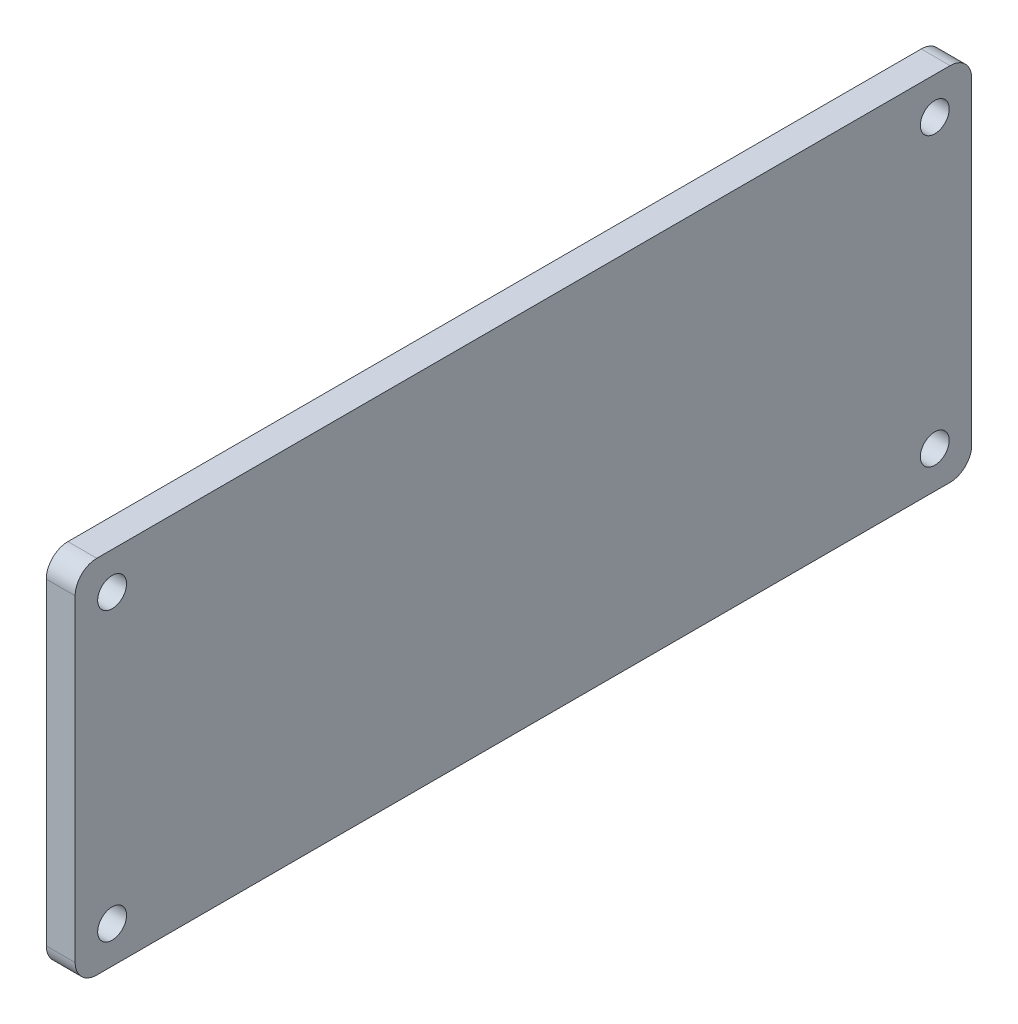
ISO-10303-21;
HEADER;
FILE_DESCRIPTION(('STEP AP214'),'2;1');
FILE_NAME('part.step','',(''),(''),'','','');
FILE_SCHEMA(('AUTOMOTIVE_DESIGN { 1 0 10303 214 1 1 1 1 }'));
ENDSEC;
DATA;
#1=APPLICATION_CONTEXT('core data for automotive mechanical design processes');
#2=APPLICATION_PROTOCOL_DEFINITION('international standard','automotive_design',2000,#1);
#3=PRODUCT_CONTEXT('',#1,'mechanical');
#4=PRODUCT('Part','Part','',(#3));
#5=PRODUCT_RELATED_PRODUCT_CATEGORY('part','',(#4));
#6=PRODUCT_DEFINITION_FORMATION('','',#4);
#7=PRODUCT_DEFINITION_CONTEXT('part definition',#1,'design');
#8=PRODUCT_DEFINITION('design','',#6,#7);
#9=PRODUCT_DEFINITION_SHAPE('','',#8);
#10=(LENGTH_UNIT() NAMED_UNIT(*) SI_UNIT(.MILLI.,.METRE.));
#11=(NAMED_UNIT(*) PLANE_ANGLE_UNIT() SI_UNIT($,.RADIAN.));
#12=(NAMED_UNIT(*) SI_UNIT($,.STERADIAN.) SOLID_ANGLE_UNIT());
#13=UNCERTAINTY_MEASURE_WITH_UNIT(LENGTH_MEASURE(1.E-05),#10,'distance_accuracy_value','');
#14=(GEOMETRIC_REPRESENTATION_CONTEXT(3) GLOBAL_UNCERTAINTY_ASSIGNED_CONTEXT((#13)) GLOBAL_UNIT_ASSIGNED_CONTEXT((#10,
#11,#12)) REPRESENTATION_CONTEXT('',''));
#15=CARTESIAN_POINT('',(0.,0.,0.));
#16=DIRECTION('',(0.,0.,1.));
#17=DIRECTION('',(1.,0.,0.));
#18=AXIS2_PLACEMENT_3D('',#15,#16,#17);
#19=CARTESIAN_POINT('',(2.,11.,29.55));
#20=DIRECTION('',(-1.,0.,0.));
#21=DIRECTION('',(0.,0.,1.));
#22=AXIS2_PLACEMENT_3D('',#19,#20,#21);
#23=PLANE('',#22);
#24=CARTESIAN_POINT('',(2.,-9.93933982822018,-28.4893398282202));
#25=DIRECTION('',(-1.,0.,0.));
#26=DIRECTION('',(0.,0.,1.));
#27=AXIS2_PLACEMENT_3D('',#24,#25,#26);
#28=CIRCLE('',#27,1.);
#29=CARTESIAN_POINT('',(2.,-9.93933982822018,-27.4893398282202));
#30=VERTEX_POINT('',#29);
#31=EDGE_CURVE('E319',#30,#30,#28,.T.);
#32=ORIENTED_EDGE('',*,*,#31,.T.);
#33=EDGE_LOOP('',(#32));
#34=FACE_BOUND('',#33,.T.);
#35=CARTESIAN_POINT('',(2.,9.93933982822018,28.4893398282202));
#36=DIRECTION('',(-1.,0.,0.));
#37=DIRECTION('',(0.,0.,1.));
#38=AXIS2_PLACEMENT_3D('',#35,#36,#37);
#39=CIRCLE('',#38,1.);
#40=CARTESIAN_POINT('',(2.,9.93933982822018,29.4893398282202));
#41=VERTEX_POINT('',#40);
#42=EDGE_CURVE('E241',#41,#41,#39,.T.);
#43=ORIENTED_EDGE('',*,*,#42,.T.);
#44=EDGE_LOOP('',(#43));
#45=FACE_BOUND('',#44,.T.);
#46=CARTESIAN_POINT('',(2.,11.,29.55));
#47=DIRECTION('',(-1.,0.,0.));
#48=DIRECTION('',(0.,0.,1.));
#49=AXIS2_PLACEMENT_3D('',#46,#47,#48);
#50=CIRCLE('',#49,1.5);
#51=CARTESIAN_POINT('',(2.,11.,31.05));
#52=VERTEX_POINT('',#51);
#53=CARTESIAN_POINT('',(2.,12.5,29.55));
#54=VERTEX_POINT('',#53);
#55=EDGE_CURVE('E257',#52,#54,#50,.T.);
#56=ORIENTED_EDGE('',*,*,#55,.F.);
#57=DIRECTION('',(0.,1.,0.));
#58=VECTOR('',#57,1.);
#59=CARTESIAN_POINT('',(2.,-11.,31.05));
#60=LINE('',#59,#58);
#61=CARTESIAN_POINT('',(2.,-11.,31.05));
#62=VERTEX_POINT('',#61);
#63=EDGE_CURVE('E232',#62,#52,#60,.T.);
#64=ORIENTED_EDGE('',*,*,#63,.F.);
#65=CARTESIAN_POINT('',(2.,-11.,29.55));
#66=DIRECTION('',(-1.,0.,0.));
#67=DIRECTION('',(0.,0.,1.));
#68=AXIS2_PLACEMENT_3D('',#65,#66,#67);
#69=CIRCLE('',#68,1.5);
#70=CARTESIAN_POINT('',(2.,-12.5,29.55));
#71=VERTEX_POINT('',#70);
#72=EDGE_CURVE('E216',#71,#62,#69,.T.);
#73=ORIENTED_EDGE('',*,*,#72,.F.);
#74=DIRECTION('',(0.,0.,-1.));
#75=VECTOR('',#74,1.);
#76=CARTESIAN_POINT('',(2.,-12.5,29.55));
#77=LINE('',#76,#75);
#78=CARTESIAN_POINT('',(2.,-12.5,-29.55));
#79=VERTEX_POINT('',#78);
#80=EDGE_CURVE('E224',#71,#79,#77,.T.);
#81=ORIENTED_EDGE('',*,*,#80,.T.);
#82=CARTESIAN_POINT('',(2.,-11.,-29.55));
#83=DIRECTION('',(1.,0.,0.));
#84=DIRECTION('',(0.,0.,-1.));
#85=AXIS2_PLACEMENT_3D('',#82,#83,#84);
#86=CIRCLE('',#85,1.5);
#87=CARTESIAN_POINT('',(2.,-11.,-31.05));
#88=VERTEX_POINT('',#87);
#89=EDGE_CURVE('E229',#79,#88,#86,.T.);
#90=ORIENTED_EDGE('',*,*,#89,.T.);
#91=DIRECTION('',(0.,1.,0.));
#92=VECTOR('',#91,1.);
#93=CARTESIAN_POINT('',(2.,-11.,-31.05));
#94=LINE('',#93,#92);
#95=CARTESIAN_POINT('',(2.,11.,-31.05));
#96=VERTEX_POINT('',#95);
#97=EDGE_CURVE('E340',#88,#96,#94,.T.);
#98=ORIENTED_EDGE('',*,*,#97,.T.);
#99=CARTESIAN_POINT('',(2.,11.,-29.55));
#100=DIRECTION('',(-1.,0.,0.));
#101=DIRECTION('',(0.,0.,1.));
#102=AXIS2_PLACEMENT_3D('',#99,#100,#101);
#103=CIRCLE('',#102,1.5);
#104=CARTESIAN_POINT('',(2.,12.5,-29.55));
#105=VERTEX_POINT('',#104);
#106=EDGE_CURVE('E337',#105,#96,#103,.T.);
#107=ORIENTED_EDGE('',*,*,#106,.F.);
#108=DIRECTION('',(0.,0.,-1.));
#109=VECTOR('',#108,1.);
#110=CARTESIAN_POINT('',(2.,12.5,29.55));
#111=LINE('',#110,#109);
#112=EDGE_CURVE('E335',#54,#105,#111,.T.);
#113=ORIENTED_EDGE('',*,*,#112,.F.);
#114=EDGE_LOOP('',(#56,#64,#73,#81,#90,#98,#107,#113));
#115=FACE_BOUND('',#114,.T.);
#116=CARTESIAN_POINT('',(2.,-9.93933982822018,28.4893398282202));
#117=DIRECTION('',(1.,0.,0.));
#118=DIRECTION('',(0.,0.,-1.));
#119=AXIS2_PLACEMENT_3D('',#116,#117,#118);
#120=CIRCLE('',#119,1.);
#121=CARTESIAN_POINT('',(2.,-9.93933982822018,27.4893398282202));
#122=VERTEX_POINT('',#121);
#123=EDGE_CURVE('E324',#122,#122,#120,.T.);
#124=ORIENTED_EDGE('',*,*,#123,.F.);
#125=EDGE_LOOP('',(#124));
#126=FACE_BOUND('',#125,.T.);
#127=CARTESIAN_POINT('',(2.,9.93933982822018,-28.4893398282202));
#128=DIRECTION('',(1.,0.,0.));
#129=DIRECTION('',(0.,0.,-1.));
#130=AXIS2_PLACEMENT_3D('',#127,#128,#129);
#131=CIRCLE('',#130,1.);
#132=CARTESIAN_POINT('',(2.,9.93933982822018,-29.4893398282202));
#133=VERTEX_POINT('',#132);
#134=EDGE_CURVE('E310',#133,#133,#131,.T.);
#135=ORIENTED_EDGE('',*,*,#134,.F.);
#136=EDGE_LOOP('',(#135));
#137=FACE_BOUND('',#136,.T.);
#138=ADVANCED_FACE('F142',(#34,#45,#115,#126,#137),#23,.F.);
#139=CARTESIAN_POINT('',(0.,11.,29.55));
#140=DIRECTION('',(-1.,0.,0.));
#141=DIRECTION('',(0.,0.,1.));
#142=AXIS2_PLACEMENT_3D('',#139,#140,#141);
#143=PLANE('',#142);
#144=CARTESIAN_POINT('',(0.,-9.93933982822018,28.4893398282202));
#145=DIRECTION('',(1.,0.,0.));
#146=DIRECTION('',(0.,0.,-1.));
#147=AXIS2_PLACEMENT_3D('',#144,#145,#146);
#148=CIRCLE('',#147,1.);
#149=CARTESIAN_POINT('',(0.,-9.93933982822018,27.4893398282202));
#150=VERTEX_POINT('',#149);
#151=EDGE_CURVE('E321',#150,#150,#148,.T.);
#152=ORIENTED_EDGE('',*,*,#151,.T.);
#153=EDGE_LOOP('',(#152));
#154=FACE_BOUND('',#153,.T.);
#155=CARTESIAN_POINT('',(0.,9.93933982822018,28.4893398282202));
#156=DIRECTION('',(-1.,0.,0.));
#157=DIRECTION('',(0.,0.,1.));
#158=AXIS2_PLACEMENT_3D('',#155,#156,#157);
#159=CIRCLE('',#158,1.);
#160=CARTESIAN_POINT('',(0.,9.93933982822018,29.4893398282202));
#161=VERTEX_POINT('',#160);
#162=EDGE_CURVE('E327',#161,#161,#159,.T.);
#163=ORIENTED_EDGE('',*,*,#162,.F.);
#164=EDGE_LOOP('',(#163));
#165=FACE_BOUND('',#164,.T.);
#166=CARTESIAN_POINT('',(0.,11.,29.55));
#167=DIRECTION('',(-1.,0.,0.));
#168=DIRECTION('',(0.,0.,1.));
#169=AXIS2_PLACEMENT_3D('',#166,#167,#168);
#170=CIRCLE('',#169,1.5);
#171=CARTESIAN_POINT('',(0.,11.,31.05));
#172=VERTEX_POINT('',#171);
#173=CARTESIAN_POINT('',(0.,12.5,29.55));
#174=VERTEX_POINT('',#173);
#175=EDGE_CURVE('E237',#172,#174,#170,.T.);
#176=ORIENTED_EDGE('',*,*,#175,.T.);
#177=DIRECTION('',(0.,0.,-1.));
#178=VECTOR('',#177,1.);
#179=CARTESIAN_POINT('',(0.,12.5,29.55));
#180=LINE('',#179,#178);
#181=CARTESIAN_POINT('',(0.,12.5,-29.55));
#182=VERTEX_POINT('',#181);
#183=EDGE_CURVE('E240',#174,#182,#180,.T.);
#184=ORIENTED_EDGE('',*,*,#183,.T.);
#185=CARTESIAN_POINT('',(0.,11.,-29.55));
#186=DIRECTION('',(-1.,0.,0.));
#187=DIRECTION('',(0.,0.,1.));
#188=AXIS2_PLACEMENT_3D('',#185,#186,#187);
#189=CIRCLE('',#188,1.5);
#190=CARTESIAN_POINT('',(0.,11.,-31.05));
#191=VERTEX_POINT('',#190);
#192=EDGE_CURVE('E244',#182,#191,#189,.T.);
#193=ORIENTED_EDGE('',*,*,#192,.T.);
#194=DIRECTION('',(0.,1.,0.));
#195=VECTOR('',#194,1.);
#196=CARTESIAN_POINT('',(0.,-11.,-31.05));
#197=LINE('',#196,#195);
#198=CARTESIAN_POINT('',(0.,-11.,-31.05));
#199=VERTEX_POINT('',#198);
#200=EDGE_CURVE('E247',#199,#191,#197,.T.);
#201=ORIENTED_EDGE('',*,*,#200,.F.);
#202=CARTESIAN_POINT('',(0.,-11.,-29.55));
#203=DIRECTION('',(1.,0.,0.));
#204=DIRECTION('',(0.,0.,-1.));
#205=AXIS2_PLACEMENT_3D('',#202,#203,#204);
#206=CIRCLE('',#205,1.5);
#207=CARTESIAN_POINT('',(0.,-12.5,-29.55));
#208=VERTEX_POINT('',#207);
#209=EDGE_CURVE('E250',#208,#199,#206,.T.);
#210=ORIENTED_EDGE('',*,*,#209,.F.);
#211=DIRECTION('',(0.,0.,-1.));
#212=VECTOR('',#211,1.);
#213=CARTESIAN_POINT('',(0.,-12.5,29.55));
#214=LINE('',#213,#212);
#215=CARTESIAN_POINT('',(0.,-12.5,29.55));
#216=VERTEX_POINT('',#215);
#217=EDGE_CURVE('E252',#216,#208,#214,.T.);
#218=ORIENTED_EDGE('',*,*,#217,.F.);
#219=CARTESIAN_POINT('',(0.,-11.,29.55));
#220=DIRECTION('',(-1.,0.,0.));
#221=DIRECTION('',(0.,0.,1.));
#222=AXIS2_PLACEMENT_3D('',#219,#220,#221);
#223=CIRCLE('',#222,1.5);
#224=CARTESIAN_POINT('',(0.,-11.,31.05));
#225=VERTEX_POINT('',#224);
#226=EDGE_CURVE('E218',#216,#225,#223,.T.);
#227=ORIENTED_EDGE('',*,*,#226,.T.);
#228=DIRECTION('',(0.,1.,0.));
#229=VECTOR('',#228,1.);
#230=CARTESIAN_POINT('',(0.,-11.,31.05));
#231=LINE('',#230,#229);
#232=EDGE_CURVE('E255',#225,#172,#231,.T.);
#233=ORIENTED_EDGE('',*,*,#232,.T.);
#234=EDGE_LOOP('',(#176,#184,#193,#201,#210,#218,#227,#233));
#235=FACE_BOUND('',#234,.T.);
#236=CARTESIAN_POINT('',(0.,-9.93933982822018,-28.4893398282202));
#237=DIRECTION('',(-1.,0.,0.));
#238=DIRECTION('',(0.,0.,1.));
#239=AXIS2_PLACEMENT_3D('',#236,#237,#238);
#240=CIRCLE('',#239,1.);
#241=CARTESIAN_POINT('',(0.,-9.93933982822018,-27.4893398282202));
#242=VERTEX_POINT('',#241);
#243=EDGE_CURVE('E316',#242,#242,#240,.T.);
#244=ORIENTED_EDGE('',*,*,#243,.F.);
#245=EDGE_LOOP('',(#244));
#246=FACE_BOUND('',#245,.T.);
#247=CARTESIAN_POINT('',(0.,9.93933982822018,-28.4893398282202));
#248=DIRECTION('',(1.,0.,0.));
#249=DIRECTION('',(0.,0.,-1.));
#250=AXIS2_PLACEMENT_3D('',#247,#248,#249);
#251=CIRCLE('',#250,1.);
#252=CARTESIAN_POINT('',(0.,9.93933982822018,-29.4893398282202));
#253=VERTEX_POINT('',#252);
#254=EDGE_CURVE('E313',#253,#253,#251,.T.);
#255=ORIENTED_EDGE('',*,*,#254,.T.);
#256=EDGE_LOOP('',(#255));
#257=FACE_BOUND('',#256,.T.);
#258=ADVANCED_FACE('F269',(#154,#165,#235,#246,#257),#143,.T.);
#259=CARTESIAN_POINT('',(2.,11.,29.55));
#260=DIRECTION('',(-1.,0.,0.));
#261=DIRECTION('',(0.,0.,1.));
#262=AXIS2_PLACEMENT_3D('',#259,#260,#261);
#263=CYLINDRICAL_SURFACE('',#262,1.5);
#264=ORIENTED_EDGE('',*,*,#175,.F.);
#265=DIRECTION('',(-1.,0.,0.));
#266=VECTOR('',#265,1.);
#267=CARTESIAN_POINT('',(2.,11.,31.05));
#268=LINE('',#267,#266);
#269=EDGE_CURVE('E12',#52,#172,#268,.T.);
#270=ORIENTED_EDGE('',*,*,#269,.F.);
#271=ORIENTED_EDGE('',*,*,#55,.T.);
#272=DIRECTION('',(-1.,0.,0.));
#273=VECTOR('',#272,1.);
#274=CARTESIAN_POINT('',(2.,12.5,29.55));
#275=LINE('',#274,#273);
#276=EDGE_CURVE('E146',#54,#174,#275,.T.);
#277=ORIENTED_EDGE('',*,*,#276,.T.);
#278=EDGE_LOOP('',(#264,#270,#271,#277));
#279=FACE_BOUND('',#278,.T.);
#280=ADVANCED_FACE('F144',(#279),#263,.T.);
#281=CARTESIAN_POINT('',(2.,-11.,31.05));
#282=DIRECTION('',(0.,0.,1.));
#283=DIRECTION('',(1.,0.,0.));
#284=AXIS2_PLACEMENT_3D('',#281,#282,#283);
#285=PLANE('',#284);
#286=ORIENTED_EDGE('',*,*,#232,.F.);
#287=DIRECTION('',(-1.,0.,0.));
#288=VECTOR('',#287,1.);
#289=CARTESIAN_POINT('',(2.,-11.,31.05));
#290=LINE('',#289,#288);
#291=EDGE_CURVE('E152',#62,#225,#290,.T.);
#292=ORIENTED_EDGE('',*,*,#291,.F.);
#293=ORIENTED_EDGE('',*,*,#63,.T.);
#294=ORIENTED_EDGE('',*,*,#269,.T.);
#295=EDGE_LOOP('',(#286,#292,#293,#294));
#296=FACE_BOUND('',#295,.T.);
#297=ADVANCED_FACE('F271',(#296),#285,.T.);
#298=CARTESIAN_POINT('',(2.,-11.,29.55));
#299=DIRECTION('',(-1.,0.,0.));
#300=DIRECTION('',(0.,0.,1.));
#301=AXIS2_PLACEMENT_3D('',#298,#299,#300);
#302=CYLINDRICAL_SURFACE('',#301,1.5);
#303=ORIENTED_EDGE('',*,*,#226,.F.);
#304=DIRECTION('',(-1.,0.,0.));
#305=VECTOR('',#304,1.);
#306=CARTESIAN_POINT('',(2.,-12.5,29.55));
#307=LINE('',#306,#305);
#308=EDGE_CURVE('E212',#71,#216,#307,.T.);
#309=ORIENTED_EDGE('',*,*,#308,.F.);
#310=ORIENTED_EDGE('',*,*,#72,.T.);
#311=ORIENTED_EDGE('',*,*,#291,.T.);
#312=EDGE_LOOP('',(#303,#309,#310,#311));
#313=FACE_BOUND('',#312,.T.);
#314=ADVANCED_FACE('F214',(#313),#302,.T.);
#315=CARTESIAN_POINT('',(2.,-12.5,29.55));
#316=DIRECTION('',(0.,1.,0.));
#317=DIRECTION('',(0.,0.,1.));
#318=AXIS2_PLACEMENT_3D('',#315,#316,#317);
#319=PLANE('',#318);
#320=ORIENTED_EDGE('',*,*,#217,.T.);
#321=DIRECTION('',(-1.,0.,0.));
#322=VECTOR('',#321,1.);
#323=CARTESIAN_POINT('',(2.,-12.5,-29.55));
#324=LINE('',#323,#322);
#325=EDGE_CURVE('E221',#79,#208,#324,.T.);
#326=ORIENTED_EDGE('',*,*,#325,.F.);
#327=ORIENTED_EDGE('',*,*,#80,.F.);
#328=ORIENTED_EDGE('',*,*,#308,.T.);
#329=EDGE_LOOP('',(#320,#326,#327,#328));
#330=FACE_BOUND('',#329,.T.);
#331=ADVANCED_FACE('F225',(#330),#319,.F.);
#332=CARTESIAN_POINT('',(2.,-11.,-29.55));
#333=DIRECTION('',(-1.,0.,0.));
#334=DIRECTION('',(0.,0.,1.));
#335=AXIS2_PLACEMENT_3D('',#332,#333,#334);
#336=CYLINDRICAL_SURFACE('',#335,1.5);
#337=ORIENTED_EDGE('',*,*,#209,.T.);
#338=DIRECTION('',(-1.,0.,0.));
#339=VECTOR('',#338,1.);
#340=CARTESIAN_POINT('',(2.,-11.,-31.05));
#341=LINE('',#340,#339);
#342=EDGE_CURVE('E261',#88,#199,#341,.T.);
#343=ORIENTED_EDGE('',*,*,#342,.F.);
#344=ORIENTED_EDGE('',*,*,#89,.F.);
#345=ORIENTED_EDGE('',*,*,#325,.T.);
#346=EDGE_LOOP('',(#337,#343,#344,#345));
#347=FACE_BOUND('',#346,.T.);
#348=ADVANCED_FACE('F346',(#347),#336,.T.);
#349=CARTESIAN_POINT('',(2.,-11.,-31.05));
#350=DIRECTION('',(0.,0.,1.));
#351=DIRECTION('',(1.,0.,0.));
#352=AXIS2_PLACEMENT_3D('',#349,#350,#351);
#353=PLANE('',#352);
#354=ORIENTED_EDGE('',*,*,#200,.T.);
#355=DIRECTION('',(-1.,0.,0.));
#356=VECTOR('',#355,1.);
#357=CARTESIAN_POINT('',(2.,11.,-31.05));
#358=LINE('',#357,#356);
#359=EDGE_CURVE('E264',#96,#191,#358,.T.);
#360=ORIENTED_EDGE('',*,*,#359,.F.);
#361=ORIENTED_EDGE('',*,*,#97,.F.);
#362=ORIENTED_EDGE('',*,*,#342,.T.);
#363=EDGE_LOOP('',(#354,#360,#361,#362));
#364=FACE_BOUND('',#363,.T.);
#365=ADVANCED_FACE('F350',(#364),#353,.F.);
#366=CARTESIAN_POINT('',(2.,11.,-29.55));
#367=DIRECTION('',(-1.,0.,0.));
#368=DIRECTION('',(0.,0.,1.));
#369=AXIS2_PLACEMENT_3D('',#366,#367,#368);
#370=CYLINDRICAL_SURFACE('',#369,1.5);
#371=ORIENTED_EDGE('',*,*,#192,.F.);
#372=DIRECTION('',(-1.,0.,0.));
#373=VECTOR('',#372,1.);
#374=CARTESIAN_POINT('',(2.,12.5,-29.55));
#375=LINE('',#374,#373);
#376=EDGE_CURVE('E265',#105,#182,#375,.T.);
#377=ORIENTED_EDGE('',*,*,#376,.F.);
#378=ORIENTED_EDGE('',*,*,#106,.T.);
#379=ORIENTED_EDGE('',*,*,#359,.T.);
#380=EDGE_LOOP('',(#371,#377,#378,#379));
#381=FACE_BOUND('',#380,.T.);
#382=ADVANCED_FACE('F352',(#381),#370,.T.);
#383=CARTESIAN_POINT('',(2.,12.5,29.55));
#384=DIRECTION('',(0.,1.,0.));
#385=DIRECTION('',(0.,0.,1.));
#386=AXIS2_PLACEMENT_3D('',#383,#384,#385);
#387=PLANE('',#386);
#388=ORIENTED_EDGE('',*,*,#183,.F.);
#389=ORIENTED_EDGE('',*,*,#276,.F.);
#390=ORIENTED_EDGE('',*,*,#112,.T.);
#391=ORIENTED_EDGE('',*,*,#376,.T.);
#392=EDGE_LOOP('',(#388,#389,#390,#391));
#393=FACE_BOUND('',#392,.T.);
#394=ADVANCED_FACE('F267',(#393),#387,.T.);
#395=CARTESIAN_POINT('',(2.,9.93933982822018,28.4893398282202));
#396=DIRECTION('',(-1.,0.,0.));
#397=DIRECTION('',(0.,0.,1.));
#398=AXIS2_PLACEMENT_3D('',#395,#396,#397);
#399=CYLINDRICAL_SURFACE('',#398,1.);
#400=ORIENTED_EDGE('',*,*,#42,.F.);
#401=EDGE_LOOP('',(#400));
#402=FACE_BOUND('',#401,.T.);
#403=ORIENTED_EDGE('',*,*,#162,.T.);
#404=EDGE_LOOP('',(#403));
#405=FACE_BOUND('',#404,.T.);
#406=ADVANCED_FACE('F290',(#402,#405),#399,.F.);
#407=CARTESIAN_POINT('',(2.,-9.93933982822018,28.4893398282202));
#408=DIRECTION('',(-1.,0.,0.));
#409=DIRECTION('',(0.,0.,1.));
#410=AXIS2_PLACEMENT_3D('',#407,#408,#409);
#411=CYLINDRICAL_SURFACE('',#410,1.);
#412=ORIENTED_EDGE('',*,*,#123,.T.);
#413=EDGE_LOOP('',(#412));
#414=FACE_BOUND('',#413,.T.);
#415=ORIENTED_EDGE('',*,*,#151,.F.);
#416=EDGE_LOOP('',(#415));
#417=FACE_BOUND('',#416,.T.);
#418=ADVANCED_FACE('F293',(#414,#417),#411,.F.);
#419=CARTESIAN_POINT('',(2.,-9.93933982822018,-28.4893398282202));
#420=DIRECTION('',(-1.,0.,0.));
#421=DIRECTION('',(0.,0.,1.));
#422=AXIS2_PLACEMENT_3D('',#419,#420,#421);
#423=CYLINDRICAL_SURFACE('',#422,1.);
#424=ORIENTED_EDGE('',*,*,#31,.F.);
#425=EDGE_LOOP('',(#424));
#426=FACE_BOUND('',#425,.T.);
#427=ORIENTED_EDGE('',*,*,#243,.T.);
#428=EDGE_LOOP('',(#427));
#429=FACE_BOUND('',#428,.T.);
#430=ADVANCED_FACE('F297',(#426,#429),#423,.F.);
#431=CARTESIAN_POINT('',(2.,9.93933982822018,-28.4893398282202));
#432=DIRECTION('',(-1.,0.,0.));
#433=DIRECTION('',(0.,0.,1.));
#434=AXIS2_PLACEMENT_3D('',#431,#432,#433);
#435=CYLINDRICAL_SURFACE('',#434,1.);
#436=ORIENTED_EDGE('',*,*,#134,.T.);
#437=EDGE_LOOP('',(#436));
#438=FACE_BOUND('',#437,.T.);
#439=ORIENTED_EDGE('',*,*,#254,.F.);
#440=EDGE_LOOP('',(#439));
#441=FACE_BOUND('',#440,.T.);
#442=ADVANCED_FACE('F301',(#438,#441),#435,.F.);
#443=CLOSED_SHELL('',(#138,#258,#280,#297,#314,#331,#348,#365,#382,#394,#406,#418,#430,#442));
#444=MANIFOLD_SOLID_BREP('B2',#443);
#445=ADVANCED_BREP_SHAPE_REPRESENTATION('',(#18,#444),#14);
#446=SHAPE_DEFINITION_REPRESENTATION(#9,#445);
ENDSEC;
END-ISO-10303-21;
